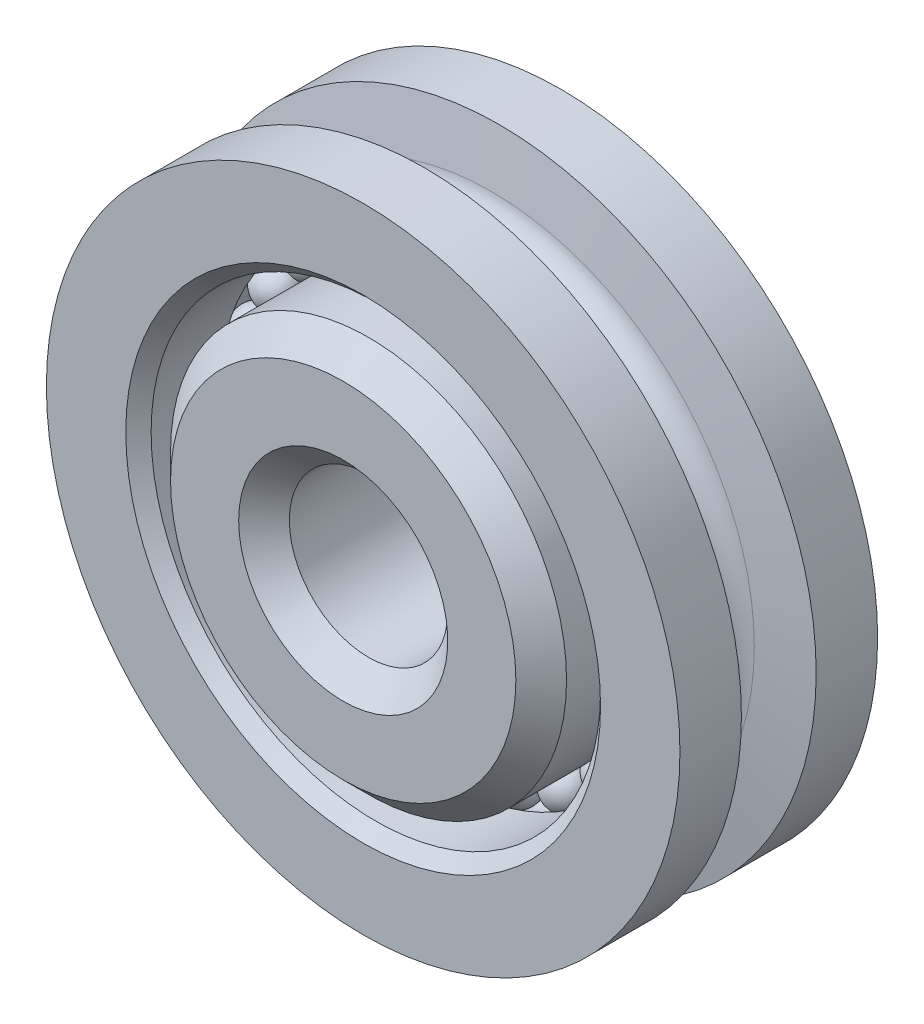
ISO-10303-21;
HEADER;
FILE_DESCRIPTION(('STEP AP214'),'2;1');
FILE_NAME('part.step','',(''),(''),'','','');
FILE_SCHEMA(('AUTOMOTIVE_DESIGN { 1 0 10303 214 1 1 1 1 }'));
ENDSEC;
DATA;
#1=APPLICATION_CONTEXT('core data for automotive mechanical design processes');
#2=APPLICATION_PROTOCOL_DEFINITION('international standard','automotive_design',2000,#1);
#3=PRODUCT_CONTEXT('',#1,'mechanical');
#4=PRODUCT('Part','Part','',(#3));
#5=PRODUCT_RELATED_PRODUCT_CATEGORY('part','',(#4));
#6=PRODUCT_DEFINITION_FORMATION('','',#4);
#7=PRODUCT_DEFINITION_CONTEXT('part definition',#1,'design');
#8=PRODUCT_DEFINITION('design','',#6,#7);
#9=PRODUCT_DEFINITION_SHAPE('','',#8);
#10=(LENGTH_UNIT() NAMED_UNIT(*) SI_UNIT(.MILLI.,.METRE.));
#11=(NAMED_UNIT(*) PLANE_ANGLE_UNIT() SI_UNIT($,.RADIAN.));
#12=(NAMED_UNIT(*) SI_UNIT($,.STERADIAN.) SOLID_ANGLE_UNIT());
#13=UNCERTAINTY_MEASURE_WITH_UNIT(LENGTH_MEASURE(1.E-05),#10,'distance_accuracy_value','');
#14=(GEOMETRIC_REPRESENTATION_CONTEXT(3) GLOBAL_UNCERTAINTY_ASSIGNED_CONTEXT((#13)) GLOBAL_UNIT_ASSIGNED_CONTEXT((#10,
#11,#12)) REPRESENTATION_CONTEXT('',''));
#15=CARTESIAN_POINT('',(0.,0.,0.));
#16=DIRECTION('',(0.,0.,1.));
#17=DIRECTION('',(1.,0.,0.));
#18=AXIS2_PLACEMENT_3D('',#15,#16,#17);
#19=CARTESIAN_POINT('',(1.09652328100494,4.09228059639296,0.));
#20=DIRECTION('',(0.258819045102507,0.965925826289075,0.));
#21=DIRECTION('',(0.,0.,-1.));
#22=AXIS2_PLACEMENT_3D('',#19,#20,#21);
#23=SPHERICAL_SURFACE('',#22,0.446484375);
#24=CARTESIAN_POINT('',(1.21208194059563,4.52355138524,0.));
#25=VERTEX_POINT('',#24);
#26=VERTEX_LOOP('',#25);
#27=FACE_BOUND('',#26,.T.);
#28=ADVANCED_FACE('F37',(#27),#23,.T.);
#29=CLOSED_SHELL('',(#28));
#30=MANIFOLD_SOLID_BREP('B2',#29);
#31=CARTESIAN_POINT('',(2.11832031249993,3.66903840795517,0.));
#32=DIRECTION('',(0.499999999999988,0.866025403784448,0.));
#33=DIRECTION('',(0.,0.,-1.));
#34=AXIS2_PLACEMENT_3D('',#31,#32,#33);
#35=SPHERICAL_SURFACE('',#34,0.446484375);
#36=CARTESIAN_POINT('',(2.34156249999992,4.05570521909799,0.));
#37=VERTEX_POINT('',#36);
#38=VERTEX_LOOP('',#37);
#39=FACE_BOUND('',#38,.T.);
#40=ADVANCED_FACE('F55',(#39),#35,.T.);
#41=CLOSED_SHELL('',(#40));
#42=MANIFOLD_SOLID_BREP('B6',#41);
#43=CARTESIAN_POINT('',(2.99575731538787,2.99575731538791,0.));
#44=DIRECTION('',(0.707106781186538,0.707106781186558,0.));
#45=DIRECTION('',(0.,0.,-1.));
#46=AXIS2_PLACEMENT_3D('',#43,#44,#45);
#47=SPHERICAL_SURFACE('',#46,0.446484375);
#48=CARTESIAN_POINT('',(3.3114694446442,3.31146944464425,0.));
#49=VERTEX_POINT('',#48);
#50=VERTEX_LOOP('',#49);
#51=FACE_BOUND('',#50,.T.);
#52=ADVANCED_FACE('F73',(#51),#47,.T.);
#53=CLOSED_SHELL('',(#52));
#54=MANIFOLD_SOLID_BREP('B33',#53);
#55=CARTESIAN_POINT('',(3.66903840795513,2.11832031249999,0.));
#56=DIRECTION('',(0.866025403784432,0.500000000000011,0.));
#57=DIRECTION('',(0.,0.,-1.));
#58=AXIS2_PLACEMENT_3D('',#55,#56,#57);
#59=SPHERICAL_SURFACE('',#58,0.446484375);
#60=CARTESIAN_POINT('',(4.05570521909794,2.34156249999999,0.));
#61=VERTEX_POINT('',#60);
#62=VERTEX_LOOP('',#61);
#63=FACE_BOUND('',#62,.T.);
#64=ADVANCED_FACE('F91',(#63),#59,.T.);
#65=CLOSED_SHELL('',(#64));
#66=MANIFOLD_SOLID_BREP('B51',#65);
#67=CARTESIAN_POINT('',(4.09228059639297,1.09652328100507,0.));
#68=DIRECTION('',(0.965925826289065,0.258819045102532,0.));
#69=DIRECTION('',(0.,0.,-1.));
#70=AXIS2_PLACEMENT_3D('',#67,#68,#69);
#71=SPHERICAL_SURFACE('',#70,0.446484375);
#72=CARTESIAN_POINT('',(4.52355138524,1.21208194059577,0.));
#73=VERTEX_POINT('',#72);
#74=VERTEX_LOOP('',#73);
#75=FACE_BOUND('',#74,.T.);
#76=ADVANCED_FACE('F109',(#75),#71,.T.);
#77=CLOSED_SHELL('',(#76));
#78=MANIFOLD_SOLID_BREP('B69',#77);
#79=CARTESIAN_POINT('',(4.23664062499996,0.,0.));
#80=DIRECTION('',(1.,0.,0.));
#81=DIRECTION('',(0.,0.,-1.));
#82=AXIS2_PLACEMENT_3D('',#79,#80,#81);
#83=SPHERICAL_SURFACE('',#82,0.446484375);
#84=CARTESIAN_POINT('',(4.68312499999996,0.,0.));
#85=VERTEX_POINT('',#84);
#86=VERTEX_LOOP('',#85);
#87=FACE_BOUND('',#86,.T.);
#88=ADVANCED_FACE('F127',(#87),#83,.T.);
#89=CLOSED_SHELL('',(#88));
#90=MANIFOLD_SOLID_BREP('B87',#89);
#91=CARTESIAN_POINT('',(4.09228059639292,-1.09652328100507,0.));
#92=DIRECTION('',(0.96592582628907,-0.258819045102512,0.));
#93=DIRECTION('',(0.,0.,-1.));
#94=AXIS2_PLACEMENT_3D('',#91,#92,#93);
#95=SPHERICAL_SURFACE('',#94,0.446484375);
#96=CARTESIAN_POINT('',(4.52355138523995,-1.21208194059576,0.));
#97=VERTEX_POINT('',#96);
#98=VERTEX_LOOP('',#97);
#99=FACE_BOUND('',#98,.T.);
#100=ADVANCED_FACE('F145',(#99),#95,.T.);
#101=CLOSED_SHELL('',(#100));
#102=MANIFOLD_SOLID_BREP('B105',#101);
#103=CARTESIAN_POINT('',(3.66903840795521,-2.11832031249998,0.));
#104=DIRECTION('',(0.866025403784443,-0.499999999999993,0.));
#105=DIRECTION('',(0.,0.,-1.));
#106=AXIS2_PLACEMENT_3D('',#103,#104,#105);
#107=SPHERICAL_SURFACE('',#106,0.446484375);
#108=CARTESIAN_POINT('',(4.05570521909803,-2.34156249999998,0.));
#109=VERTEX_POINT('',#108);
#110=VERTEX_LOOP('',#109);
#111=FACE_BOUND('',#110,.T.);
#112=ADVANCED_FACE('F163',(#111),#107,.T.);
#113=CLOSED_SHELL('',(#112));
#114=MANIFOLD_SOLID_BREP('B123',#113);
#115=CARTESIAN_POINT('',(2.99575731538792,-2.99575731538795,0.));
#116=DIRECTION('',(0.707106781186553,-0.707106781186543,0.));
#117=DIRECTION('',(0.,0.,-1.));
#118=AXIS2_PLACEMENT_3D('',#115,#116,#117);
#119=SPHERICAL_SURFACE('',#118,0.446484375);
#120=CARTESIAN_POINT('',(3.31146944464426,-3.31146944464428,0.));
#121=VERTEX_POINT('',#120);
#122=VERTEX_LOOP('',#121);
#123=FACE_BOUND('',#122,.T.);
#124=ADVANCED_FACE('F181',(#123),#119,.T.);
#125=CLOSED_SHELL('',(#124));
#126=MANIFOLD_SOLID_BREP('B141',#125);
#127=CARTESIAN_POINT('',(2.11832031250006,-3.66903840795521,0.));
#128=DIRECTION('',(0.500000000000007,-0.866025403784437,0.));
#129=DIRECTION('',(0.,0.,-1.));
#130=AXIS2_PLACEMENT_3D('',#127,#128,#129);
#131=SPHERICAL_SURFACE('',#130,0.446484375);
#132=CARTESIAN_POINT('',(2.34156250000006,-4.05570521909803,0.));
#133=VERTEX_POINT('',#132);
#134=VERTEX_LOOP('',#133);
#135=FACE_BOUND('',#134,.T.);
#136=ADVANCED_FACE('F199',(#135),#131,.T.);
#137=CLOSED_SHELL('',(#136));
#138=MANIFOLD_SOLID_BREP('B159',#137);
#139=CARTESIAN_POINT('',(1.09652328100505,-4.09228059639302,0.));
#140=DIRECTION('',(0.258819045102528,-0.965925826289069,0.));
#141=DIRECTION('',(0.,0.,-1.));
#142=AXIS2_PLACEMENT_3D('',#139,#140,#141);
#143=SPHERICAL_SURFACE('',#142,0.446484375);
#144=CARTESIAN_POINT('',(1.21208194059575,-4.52355138524006,0.));
#145=VERTEX_POINT('',#144);
#146=VERTEX_LOOP('',#145);
#147=FACE_BOUND('',#146,.T.);
#148=ADVANCED_FACE('F217',(#147),#143,.T.);
#149=CLOSED_SHELL('',(#148));
#150=MANIFOLD_SOLID_BREP('B177',#149);
#151=CARTESIAN_POINT('',(0.,-4.23664062500007,0.));
#152=DIRECTION('',(0.,-1.,0.));
#153=DIRECTION('',(0.,0.,-1.));
#154=AXIS2_PLACEMENT_3D('',#151,#152,#153);
#155=SPHERICAL_SURFACE('',#154,0.446484375);
#156=CARTESIAN_POINT('',(0.,-4.68312500000007,0.));
#157=VERTEX_POINT('',#156);
#158=VERTEX_LOOP('',#157);
#159=FACE_BOUND('',#158,.T.);
#160=ADVANCED_FACE('F235',(#159),#155,.T.);
#161=CLOSED_SHELL('',(#160));
#162=MANIFOLD_SOLID_BREP('B195',#161);
#163=CARTESIAN_POINT('',(-1.09652328100505,-4.09228059639299,0.));
#164=DIRECTION('',(-0.258819045102514,-0.965925826289073,0.));
#165=DIRECTION('',(0.,0.,-1.));
#166=AXIS2_PLACEMENT_3D('',#163,#164,#165);
#167=SPHERICAL_SURFACE('',#166,0.446484375);
#168=CARTESIAN_POINT('',(-1.21208194059575,-4.52355138524003,0.));
#169=VERTEX_POINT('',#168);
#170=VERTEX_LOOP('',#169);
#171=FACE_BOUND('',#170,.T.);
#172=ADVANCED_FACE('F253',(#171),#167,.T.);
#173=CLOSED_SHELL('',(#172));
#174=MANIFOLD_SOLID_BREP('B213',#173);
#175=CARTESIAN_POINT('',(-2.11832031250002,-3.66903840795525,0.));
#176=DIRECTION('',(-0.499999999999995,-0.866025403784444,0.));
#177=DIRECTION('',(0.,0.,-1.));
#178=AXIS2_PLACEMENT_3D('',#175,#176,#177);
#179=SPHERICAL_SURFACE('',#178,0.446484375);
#180=CARTESIAN_POINT('',(-2.34156250000002,-4.05570521909807,0.));
#181=VERTEX_POINT('',#180);
#182=VERTEX_LOOP('',#181);
#183=FACE_BOUND('',#182,.T.);
#184=ADVANCED_FACE('F271',(#183),#179,.T.);
#185=CLOSED_SHELL('',(#184));
#186=MANIFOLD_SOLID_BREP('B231',#185);
#187=CARTESIAN_POINT('',(-2.99575731538794,-2.99575731538796,0.));
#188=DIRECTION('',(-0.707106781186543,-0.707106781186553,0.));
#189=DIRECTION('',(0.,0.,-1.));
#190=AXIS2_PLACEMENT_3D('',#187,#188,#189);
#191=SPHERICAL_SURFACE('',#190,0.446484375);
#192=CARTESIAN_POINT('',(-3.31146944464428,-3.3114694446443,0.));
#193=VERTEX_POINT('',#192);
#194=VERTEX_LOOP('',#193);
#195=FACE_BOUND('',#194,.T.);
#196=ADVANCED_FACE('F289',(#195),#191,.T.);
#197=CLOSED_SHELL('',(#196));
#198=MANIFOLD_SOLID_BREP('B249',#197);
#199=CARTESIAN_POINT('',(-3.66903840795519,-2.11832031250008,0.));
#200=DIRECTION('',(-0.866025403784436,-0.500000000000005,0.));
#201=DIRECTION('',(0.,0.,-1.));
#202=AXIS2_PLACEMENT_3D('',#199,#200,#201);
#203=SPHERICAL_SURFACE('',#202,0.446484375);
#204=CARTESIAN_POINT('',(-4.05570521909801,-2.34156250000009,0.));
#205=VERTEX_POINT('',#204);
#206=VERTEX_LOOP('',#205);
#207=FACE_BOUND('',#206,.T.);
#208=ADVANCED_FACE('F307',(#207),#203,.T.);
#209=CLOSED_SHELL('',(#208));
#210=MANIFOLD_SOLID_BREP('B267',#209);
#211=CARTESIAN_POINT('',(-4.09228059639301,-1.0965232810051,0.));
#212=DIRECTION('',(-0.965925826289067,-0.258819045102525,0.));
#213=DIRECTION('',(0.,0.,-1.));
#214=AXIS2_PLACEMENT_3D('',#211,#212,#213);
#215=SPHERICAL_SURFACE('',#214,0.446484375);
#216=CARTESIAN_POINT('',(-4.52355138524004,-1.21208194059579,0.));
#217=VERTEX_POINT('',#216);
#218=VERTEX_LOOP('',#217);
#219=FACE_BOUND('',#218,.T.);
#220=ADVANCED_FACE('F325',(#219),#215,.T.);
#221=CLOSED_SHELL('',(#220));
#222=MANIFOLD_SOLID_BREP('B285',#221);
#223=CARTESIAN_POINT('',(-4.23664062500002,-1.11022302462516E-13,0.));
#224=DIRECTION('',(-0.999999999999999,0.,0.));
#225=DIRECTION('',(0.,0.,-1.));
#226=AXIS2_PLACEMENT_3D('',#223,#224,#225);
#227=SPHERICAL_SURFACE('',#226,0.446484375);
#228=CARTESIAN_POINT('',(-4.68312500000002,-1.12633318470612E-13,0.));
#229=VERTEX_POINT('',#228);
#230=VERTEX_LOOP('',#229);
#231=FACE_BOUND('',#230,.T.);
#232=ADVANCED_FACE('F343',(#231),#227,.T.);
#233=CLOSED_SHELL('',(#232));
#234=MANIFOLD_SOLID_BREP('B303',#233);
#235=CARTESIAN_POINT('',(-4.09228059639304,1.09652328100495,0.));
#236=DIRECTION('',(-0.965925826289069,0.258819045102519,0.));
#237=DIRECTION('',(0.,0.,-1.));
#238=AXIS2_PLACEMENT_3D('',#235,#236,#237);
#239=SPHERICAL_SURFACE('',#238,0.446484375);
#240=CARTESIAN_POINT('',(-4.52355138524008,1.21208194059564,0.));
#241=VERTEX_POINT('',#240);
#242=VERTEX_LOOP('',#241);
#243=FACE_BOUND('',#242,.T.);
#244=ADVANCED_FACE('F361',(#243),#239,.T.);
#245=CLOSED_SHELL('',(#244));
#246=MANIFOLD_SOLID_BREP('B321',#245);
#247=CARTESIAN_POINT('',(-3.66903840795522,2.11832031249995,0.));
#248=DIRECTION('',(-0.866025403784439,0.499999999999999,0.));
#249=DIRECTION('',(0.,0.,-1.));
#250=AXIS2_PLACEMENT_3D('',#247,#248,#249);
#251=SPHERICAL_SURFACE('',#250,0.446484375);
#252=CARTESIAN_POINT('',(-4.05570521909804,2.34156249999995,0.));
#253=VERTEX_POINT('',#252);
#254=VERTEX_LOOP('',#253);
#255=FACE_BOUND('',#254,.T.);
#256=ADVANCED_FACE('F379',(#255),#251,.T.);
#257=CLOSED_SHELL('',(#256));
#258=MANIFOLD_SOLID_BREP('B339',#257);
#259=CARTESIAN_POINT('',(-2.99575731538797,2.99575731538784,0.));
#260=DIRECTION('',(-0.707106781186549,0.707106781186548,0.));
#261=DIRECTION('',(0.,0.,-1.));
#262=AXIS2_PLACEMENT_3D('',#259,#260,#261);
#263=SPHERICAL_SURFACE('',#262,0.446484375);
#264=CARTESIAN_POINT('',(-3.31146944464431,3.31146944464418,0.));
#265=VERTEX_POINT('',#264);
#266=VERTEX_LOOP('',#265);
#267=FACE_BOUND('',#266,.T.);
#268=ADVANCED_FACE('F397',(#267),#263,.T.);
#269=CLOSED_SHELL('',(#268));
#270=MANIFOLD_SOLID_BREP('B357',#269);
#271=CARTESIAN_POINT('',(-2.11832031250005,3.66903840795516,0.));
#272=DIRECTION('',(-0.500000000000001,0.866025403784441,0.));
#273=DIRECTION('',(0.,0.,-1.));
#274=AXIS2_PLACEMENT_3D('',#271,#272,#273);
#275=SPHERICAL_SURFACE('',#274,0.446484375);
#276=CARTESIAN_POINT('',(-2.34156250000005,4.05570521909797,0.));
#277=VERTEX_POINT('',#276);
#278=VERTEX_LOOP('',#277);
#279=FACE_BOUND('',#278,.T.);
#280=ADVANCED_FACE('F415',(#279),#275,.T.);
#281=CLOSED_SHELL('',(#280));
#282=MANIFOLD_SOLID_BREP('B375',#281);
#283=CARTESIAN_POINT('',(-1.0965232810051,4.09228059639292,0.));
#284=DIRECTION('',(-0.258819045102522,0.965925826289071,0.));
#285=DIRECTION('',(0.,0.,-1.));
#286=AXIS2_PLACEMENT_3D('',#283,#284,#285);
#287=SPHERICAL_SURFACE('',#286,0.446484375);
#288=CARTESIAN_POINT('',(-1.21208194059579,4.52355138523995,0.));
#289=VERTEX_POINT('',#288);
#290=VERTEX_LOOP('',#289);
#291=FACE_BOUND('',#290,.T.);
#292=ADVANCED_FACE('F433',(#291),#287,.T.);
#293=CLOSED_SHELL('',(#292));
#294=MANIFOLD_SOLID_BREP('B393',#293);
#295=CARTESIAN_POINT('',(0.,4.23664062499995,0.));
#296=DIRECTION('',(0.,1.,0.));
#297=DIRECTION('',(0.,0.,-1.));
#298=AXIS2_PLACEMENT_3D('',#295,#296,#297);
#299=SPHERICAL_SURFACE('',#298,0.446484375);
#300=CARTESIAN_POINT('',(0.,4.68312499999996,0.));
#301=VERTEX_POINT('',#300);
#302=VERTEX_LOOP('',#301);
#303=FACE_BOUND('',#302,.T.);
#304=ADVANCED_FACE('F453',(#303),#299,.T.);
#305=CLOSED_SHELL('',(#304));
#306=MANIFOLD_SOLID_BREP('B411',#305);
#307=CARTESIAN_POINT('',(0.,3.96875,2.38124999999997));
#308=DIRECTION('',(0.,0.,-1.));
#309=DIRECTION('',(-0.999999999999999,0.,0.));
#310=AXIS2_PLACEMENT_3D('',#307,#308,#309);
#311=PLANE('',#310);
#312=CARTESIAN_POINT('',(0.,0.,2.38124999999989));
#313=DIRECTION('',(0.,0.,-1.));
#314=DIRECTION('',(-0.999999999999999,0.,0.));
#315=AXIS2_PLACEMENT_3D('',#312,#313,#314);
#316=CIRCLE('',#315,3.46075);
#317=CARTESIAN_POINT('',(-3.46075000000004,0.,2.38124999999989));
#318=VERTEX_POINT('',#317);
#319=EDGE_CURVE('E479',#318,#318,#316,.F.);
#320=ORIENTED_EDGE('',*,*,#319,.T.);
#321=EDGE_LOOP('',(#320));
#322=FACE_BOUND('',#321,.T.);
#323=CARTESIAN_POINT('',(0.,0.,2.38124999999989));
#324=DIRECTION('',(0.,0.,-1.));
#325=DIRECTION('',(-0.999999999999999,0.,0.));
#326=AXIS2_PLACEMENT_3D('',#323,#324,#325);
#327=CIRCLE('',#326,2.09550000000001);
#328=CARTESIAN_POINT('',(-2.09550000000005,0.,2.38124999999989));
#329=VERTEX_POINT('',#328);
#330=EDGE_CURVE('E483',#329,#329,#327,.T.);
#331=ORIENTED_EDGE('',*,*,#330,.T.);
#332=EDGE_LOOP('',(#331));
#333=FACE_BOUND('',#332,.T.);
#334=ADVANCED_FACE('F472',(#322,#333),#311,.F.);
#335=CARTESIAN_POINT('',(0.,0.,2.38124999999989));
#336=DIRECTION('',(0.,0.,1.));
#337=DIRECTION('',(0.999999999999999,0.,0.));
#338=AXIS2_PLACEMENT_3D('',#335,#336,#337);
#339=CYLINDRICAL_SURFACE('',#338,1.5875);
#340=CARTESIAN_POINT('',(0.,0.,-1.87325000000001));
#341=DIRECTION('',(0.,0.,1.));
#342=DIRECTION('',(0.999999999999999,0.,0.));
#343=AXIS2_PLACEMENT_3D('',#340,#341,#342);
#344=CIRCLE('',#343,1.5875);
#345=CARTESIAN_POINT('',(1.58749999999993,0.,-1.87325000000001));
#346=VERTEX_POINT('',#345);
#347=EDGE_CURVE('E492',#346,#346,#344,.F.);
#348=ORIENTED_EDGE('',*,*,#347,.T.);
#349=EDGE_LOOP('',(#348));
#350=FACE_BOUND('',#349,.T.);
#351=CARTESIAN_POINT('',(0.,0.,1.87324999999992));
#352=DIRECTION('',(0.,0.,-1.));
#353=DIRECTION('',(-0.999999999999999,0.,0.));
#354=AXIS2_PLACEMENT_3D('',#351,#352,#353);
#355=CIRCLE('',#354,1.5875);
#356=CARTESIAN_POINT('',(-1.58750000000004,0.,1.87324999999992));
#357=VERTEX_POINT('',#356);
#358=EDGE_CURVE('E495',#357,#357,#355,.F.);
#359=ORIENTED_EDGE('',*,*,#358,.T.);
#360=EDGE_LOOP('',(#359));
#361=FACE_BOUND('',#360,.T.);
#362=ADVANCED_FACE('F527',(#350,#361),#339,.F.);
#363=CARTESIAN_POINT('',(0.,3.96874999999996,-2.38125000000003));
#364=DIRECTION('',(0.,0.,1.));
#365=DIRECTION('',(0.999999999999999,0.,0.));
#366=AXIS2_PLACEMENT_3D('',#363,#364,#365);
#367=PLANE('',#366);
#368=CARTESIAN_POINT('',(0.,0.,-2.38125000000004));
#369=DIRECTION('',(0.,0.,1.));
#370=DIRECTION('',(0.999999999999999,0.,0.));
#371=AXIS2_PLACEMENT_3D('',#368,#369,#370);
#372=CIRCLE('',#371,2.0955);
#373=CARTESIAN_POINT('',(2.09549999999996,0.,-2.38125000000004));
#374=VERTEX_POINT('',#373);
#375=EDGE_CURVE('E498',#374,#374,#372,.T.);
#376=ORIENTED_EDGE('',*,*,#375,.T.);
#377=EDGE_LOOP('',(#376));
#378=FACE_BOUND('',#377,.T.);
#379=CARTESIAN_POINT('',(0.,0.,-2.38125000000004));
#380=DIRECTION('',(0.,0.,1.));
#381=DIRECTION('',(0.999999999999999,0.,0.));
#382=AXIS2_PLACEMENT_3D('',#379,#380,#381);
#383=CIRCLE('',#382,3.46075);
#384=CARTESIAN_POINT('',(3.46074999999996,0.,-2.38125000000004));
#385=VERTEX_POINT('',#384);
#386=EDGE_CURVE('E501',#385,#385,#383,.F.);
#387=ORIENTED_EDGE('',*,*,#386,.T.);
#388=EDGE_LOOP('',(#387));
#389=FACE_BOUND('',#388,.T.);
#390=ADVANCED_FACE('F521',(#378,#389),#367,.F.);
#391=CARTESIAN_POINT('',(0.,0.,2.38124999999989));
#392=DIRECTION('',(0.,0.,1.));
#393=DIRECTION('',(0.999999999999999,0.,0.));
#394=AXIS2_PLACEMENT_3D('',#391,#392,#393);
#395=CYLINDRICAL_SURFACE('',#394,3.96875);
#396=CARTESIAN_POINT('',(0.,0.,-1.87325000000008));
#397=DIRECTION('',(0.,0.,1.));
#398=DIRECTION('',(0.999999999999999,0.,0.));
#399=AXIS2_PLACEMENT_3D('',#396,#397,#398);
#400=CIRCLE('',#399,3.96875);
#401=CARTESIAN_POINT('',(3.96874999999996,0.,-1.87325000000008));
#402=VERTEX_POINT('',#401);
#403=EDGE_CURVE('E487',#402,#402,#400,.T.);
#404=ORIENTED_EDGE('',*,*,#403,.T.);
#405=EDGE_LOOP('',(#404));
#406=FACE_BOUND('',#405,.T.);
#407=CARTESIAN_POINT('',(0.,0.,-0.357187500000106));
#408=DIRECTION('',(0.,0.,1.));
#409=DIRECTION('',(0.999999999999999,0.,0.));
#410=AXIS2_PLACEMENT_3D('',#407,#408,#409);
#411=CIRCLE('',#410,3.96875);
#412=CARTESIAN_POINT('',(3.96874999999994,0.,-0.357187500000107));
#413=VERTEX_POINT('',#412);
#414=EDGE_CURVE('E504',#413,#413,#411,.T.);
#415=ORIENTED_EDGE('',*,*,#414,.F.);
#416=EDGE_LOOP('',(#415));
#417=FACE_BOUND('',#416,.T.);
#418=ADVANCED_FACE('F516',(#406,#417),#395,.T.);
#419=CARTESIAN_POINT('',(0.,0.,0.));
#420=DIRECTION('',(0.,0.,1.));
#421=DIRECTION('',(0.999999999999999,0.,0.));
#422=AXIS2_PLACEMENT_3D('',#419,#420,#421);
#423=TOROIDAL_SURFACE('',#422,4.236640625,0.446484375);
#424=CARTESIAN_POINT('',(0.,0.,0.357187499999925));
#425=DIRECTION('',(0.,0.,1.));
#426=DIRECTION('',(0.999999999999999,0.,0.));
#427=AXIS2_PLACEMENT_3D('',#424,#425,#426);
#428=CIRCLE('',#427,3.96875);
#429=CARTESIAN_POINT('',(3.96874999999997,0.,0.357187499999924));
#430=VERTEX_POINT('',#429);
#431=EDGE_CURVE('E507',#430,#430,#428,.T.);
#432=ORIENTED_EDGE('',*,*,#431,.F.);
#433=EDGE_LOOP('',(#432));
#434=FACE_BOUND('',#433,.T.);
#435=ORIENTED_EDGE('',*,*,#414,.T.);
#436=EDGE_LOOP('',(#435));
#437=FACE_BOUND('',#436,.T.);
#438=ADVANCED_FACE('F513',(#434,#437),#423,.F.);
#439=CARTESIAN_POINT('',(0.,0.,2.38124999999989));
#440=DIRECTION('',(0.,0.,1.));
#441=DIRECTION('',(0.999999999999999,0.,0.));
#442=AXIS2_PLACEMENT_3D('',#439,#440,#441);
#443=CYLINDRICAL_SURFACE('',#442,3.96875);
#444=CARTESIAN_POINT('',(0.,0.,1.87324999999992));
#445=DIRECTION('',(0.,0.,-1.));
#446=DIRECTION('',(-0.999999999999999,0.,0.));
#447=AXIS2_PLACEMENT_3D('',#444,#445,#446);
#448=CIRCLE('',#447,3.96875);
#449=CARTESIAN_POINT('',(-3.96875000000004,0.,1.87324999999993));
#450=VERTEX_POINT('',#449);
#451=EDGE_CURVE('E452',#450,#450,#448,.T.);
#452=ORIENTED_EDGE('',*,*,#451,.T.);
#453=EDGE_LOOP('',(#452));
#454=FACE_BOUND('',#453,.T.);
#455=ORIENTED_EDGE('',*,*,#431,.T.);
#456=EDGE_LOOP('',(#455));
#457=FACE_BOUND('',#456,.T.);
#458=ADVANCED_FACE('F511',(#454,#457),#443,.T.);
#459=CARTESIAN_POINT('',(0.,0.,-2.38125000000004));
#460=DIRECTION('',(0.,0.,-1.));
#461=DIRECTION('',(-0.999999999999999,0.,0.));
#462=AXIS2_PLACEMENT_3D('',#459,#460,#461);
#463=CONICAL_SURFACE('',#462,2.0955,0.785398163397447);
#464=ORIENTED_EDGE('',*,*,#347,.F.);
#465=EDGE_LOOP('',(#464));
#466=FACE_BOUND('',#465,.T.);
#467=ORIENTED_EDGE('',*,*,#375,.F.);
#468=EDGE_LOOP('',(#467));
#469=FACE_BOUND('',#468,.T.);
#470=ADVANCED_FACE('F539',(#466,#469),#463,.F.);
#471=CARTESIAN_POINT('',(0.,0.,-1.87325000000008));
#472=DIRECTION('',(0.,0.,1.));
#473=DIRECTION('',(0.999999999999999,0.,0.));
#474=AXIS2_PLACEMENT_3D('',#471,#472,#473);
#475=CONICAL_SURFACE('',#474,3.96875,0.785398163397451);
#476=ORIENTED_EDGE('',*,*,#386,.F.);
#477=EDGE_LOOP('',(#476));
#478=FACE_BOUND('',#477,.T.);
#479=ORIENTED_EDGE('',*,*,#403,.F.);
#480=EDGE_LOOP('',(#479));
#481=FACE_BOUND('',#480,.T.);
#482=ADVANCED_FACE('F542',(#478,#481),#475,.T.);
#483=CARTESIAN_POINT('',(0.,0.,2.38124999999989));
#484=DIRECTION('',(0.,0.,-1.));
#485=DIRECTION('',(-0.999999999999999,0.,0.));
#486=AXIS2_PLACEMENT_3D('',#483,#484,#485);
#487=CONICAL_SURFACE('',#486,3.46075,0.785398163397447);
#488=ORIENTED_EDGE('',*,*,#451,.F.);
#489=EDGE_LOOP('',(#488));
#490=FACE_BOUND('',#489,.T.);
#491=ORIENTED_EDGE('',*,*,#319,.F.);
#492=EDGE_LOOP('',(#491));
#493=FACE_BOUND('',#492,.T.);
#494=ADVANCED_FACE('F545',(#490,#493),#487,.T.);
#495=CARTESIAN_POINT('',(0.,0.,1.87324999999992));
#496=DIRECTION('',(0.,0.,1.));
#497=DIRECTION('',(0.999999999999999,0.,0.));
#498=AXIS2_PLACEMENT_3D('',#495,#496,#497);
#499=CONICAL_SURFACE('',#498,1.5875,0.78539816339745);
#500=ORIENTED_EDGE('',*,*,#330,.F.);
#501=EDGE_LOOP('',(#500));
#502=FACE_BOUND('',#501,.T.);
#503=ORIENTED_EDGE('',*,*,#358,.F.);
#504=EDGE_LOOP('',(#503));
#505=FACE_BOUND('',#504,.T.);
#506=ADVANCED_FACE('F474',(#502,#505),#499,.F.);
#507=CLOSED_SHELL('',(#334,#362,#390,#418,#438,#458,#470,#482,#494,#506));
#508=MANIFOLD_SOLID_BREP('B429',#507);
#509=CARTESIAN_POINT('',(0.,0.,0.));
#510=DIRECTION('',(0.,0.,1.));
#511=DIRECTION('',(0.999999999999999,0.,0.));
#512=AXIS2_PLACEMENT_3D('',#509,#510,#511);
#513=TOROIDAL_SURFACE('',#512,5.3578125,0.5953125);
#514=CARTESIAN_POINT('',(0.,0.,0.588845645764391));
#515=DIRECTION('',(0.,0.,1.));
#516=DIRECTION('',(0.999999999999999,0.,0.));
#517=AXIS2_PLACEMENT_3D('',#514,#515,#516);
#518=CIRCLE('',#517,5.27030376831867);
#519=CARTESIAN_POINT('',(5.27030376831863,0.,0.58884564576439));
#520=VERTEX_POINT('',#519);
#521=EDGE_CURVE('E643',#520,#520,#518,.T.);
#522=ORIENTED_EDGE('',*,*,#521,.F.);
#523=EDGE_LOOP('',(#522));
#524=FACE_BOUND('',#523,.T.);
#525=CARTESIAN_POINT('',(0.,0.,-0.588845645764537));
#526=DIRECTION('',(0.,0.,1.));
#527=DIRECTION('',(0.999999999999999,0.,0.));
#528=AXIS2_PLACEMENT_3D('',#525,#526,#527);
#529=CIRCLE('',#528,5.27030376831867);
#530=CARTESIAN_POINT('',(5.27030376831866,0.,-0.588845645764538));
#531=VERTEX_POINT('',#530);
#532=EDGE_CURVE('E664',#531,#531,#529,.T.);
#533=ORIENTED_EDGE('',*,*,#532,.T.);
#534=EDGE_LOOP('',(#533));
#535=FACE_BOUND('',#534,.T.);
#536=ADVANCED_FACE('F623',(#524,#535),#513,.F.);
#537=CARTESIAN_POINT('',(0.,0.,0.588845645764391));
#538=DIRECTION('',(0.,0.,1.));
#539=DIRECTION('',(0.999999999999999,0.,0.));
#540=AXIS2_PLACEMENT_3D('',#537,#538,#539);
#541=CONICAL_SURFACE('',#540,5.27030376831867,1.42326543698228);
#542=CARTESIAN_POINT('',(0.,0.,0.749299999999953));
#543=DIRECTION('',(0.,0.,1.));
#544=DIRECTION('',(0.999999999999999,0.,0.));
#545=AXIS2_PLACEMENT_3D('',#542,#543,#544);
#546=CIRCLE('',#545,6.35);
#547=CARTESIAN_POINT('',(6.34999999999998,0.,0.749299999999951));
#548=VERTEX_POINT('',#547);
#549=EDGE_CURVE('E646',#548,#548,#546,.T.);
#550=ORIENTED_EDGE('',*,*,#549,.F.);
#551=EDGE_LOOP('',(#550));
#552=FACE_BOUND('',#551,.T.);
#553=ORIENTED_EDGE('',*,*,#521,.T.);
#554=EDGE_LOOP('',(#553));
#555=FACE_BOUND('',#554,.T.);
#556=ADVANCED_FACE('F694',(#552,#555),#541,.T.);
#557=CARTESIAN_POINT('',(0.,0.,2.38124999999997));
#558=DIRECTION('',(0.,0.,1.));
#559=DIRECTION('',(0.999999999999999,0.,0.));
#560=AXIS2_PLACEMENT_3D('',#557,#558,#559);
#561=CYLINDRICAL_SURFACE('',#560,6.35);
#562=CARTESIAN_POINT('',(0.,0.,1.98119999999994));
#563=DIRECTION('',(0.,0.,1.));
#564=DIRECTION('',(0.999999999999999,0.,0.));
#565=AXIS2_PLACEMENT_3D('',#562,#563,#564);
#566=CIRCLE('',#565,6.35);
#567=CARTESIAN_POINT('',(6.34999999999995,0.,1.98119999999994));
#568=VERTEX_POINT('',#567);
#569=EDGE_CURVE('E649',#568,#568,#566,.T.);
#570=ORIENTED_EDGE('',*,*,#569,.F.);
#571=EDGE_LOOP('',(#570));
#572=FACE_BOUND('',#571,.T.);
#573=ORIENTED_EDGE('',*,*,#549,.T.);
#574=EDGE_LOOP('',(#573));
#575=FACE_BOUND('',#574,.T.);
#576=ADVANCED_FACE('F700',(#572,#575),#561,.T.);
#577=CARTESIAN_POINT('',(0.,4.50453125,1.98119999999994));
#578=DIRECTION('',(0.,0.,-1.));
#579=DIRECTION('',(-0.999999999999999,0.,0.));
#580=AXIS2_PLACEMENT_3D('',#577,#578,#579);
#581=PLANE('',#580);
#582=CARTESIAN_POINT('',(0.,0.,1.98119999999994));
#583=DIRECTION('',(0.,0.,-1.));
#584=DIRECTION('',(-0.999999999999999,0.,0.));
#585=AXIS2_PLACEMENT_3D('',#582,#583,#584);
#586=CIRCLE('',#585,4.75853125);
#587=CARTESIAN_POINT('',(-4.75853125000004,0.,1.98119999999994));
#588=VERTEX_POINT('',#587);
#589=EDGE_CURVE('E471',#588,#588,#586,.T.);
#590=ORIENTED_EDGE('',*,*,#589,.T.);
#591=EDGE_LOOP('',(#590));
#592=FACE_BOUND('',#591,.T.);
#593=ORIENTED_EDGE('',*,*,#569,.T.);
#594=EDGE_LOOP('',(#593));
#595=FACE_BOUND('',#594,.T.);
#596=ADVANCED_FACE('F724',(#592,#595),#581,.F.);
#597=CARTESIAN_POINT('',(0.,0.,2.38124999999997));
#598=DIRECTION('',(0.,0.,1.));
#599=DIRECTION('',(0.999999999999999,0.,0.));
#600=AXIS2_PLACEMENT_3D('',#597,#598,#599);
#601=CYLINDRICAL_SURFACE('',#600,4.50453125);
#602=CARTESIAN_POINT('',(0.,0.,1.72719999999992));
#603=DIRECTION('',(0.,0.,-1.));
#604=DIRECTION('',(-0.999999999999999,0.,0.));
#605=AXIS2_PLACEMENT_3D('',#602,#603,#604);
#606=CIRCLE('',#605,4.50453125);
#607=CARTESIAN_POINT('',(-4.50453125000003,0.,1.72719999999992));
#608=VERTEX_POINT('',#607);
#609=EDGE_CURVE('E630',#608,#608,#606,.F.);
#610=ORIENTED_EDGE('',*,*,#609,.T.);
#611=EDGE_LOOP('',(#610));
#612=FACE_BOUND('',#611,.T.);
#613=CARTESIAN_POINT('',(0.,0.,0.357187499999904));
#614=DIRECTION('',(0.,0.,1.));
#615=DIRECTION('',(0.999999999999999,0.,0.));
#616=AXIS2_PLACEMENT_3D('',#613,#614,#615);
#617=CIRCLE('',#616,4.50453125);
#618=CARTESIAN_POINT('',(4.50453125000002,0.,0.357187499999903));
#619=VERTEX_POINT('',#618);
#620=EDGE_CURVE('E652',#619,#619,#617,.T.);
#621=ORIENTED_EDGE('',*,*,#620,.F.);
#622=EDGE_LOOP('',(#621));
#623=FACE_BOUND('',#622,.T.);
#624=ADVANCED_FACE('F719',(#612,#623),#601,.F.);
#625=CARTESIAN_POINT('',(0.,0.,0.));
#626=DIRECTION('',(0.,0.,1.));
#627=DIRECTION('',(0.999999999999999,0.,0.));
#628=AXIS2_PLACEMENT_3D('',#625,#626,#627);
#629=TOROIDAL_SURFACE('',#628,4.236640625,0.446484375);
#630=CARTESIAN_POINT('',(0.,0.,-0.357187500000071));
#631=DIRECTION('',(0.,0.,1.));
#632=DIRECTION('',(0.999999999999999,0.,0.));
#633=AXIS2_PLACEMENT_3D('',#630,#631,#632);
#634=CIRCLE('',#633,4.50453125);
#635=CARTESIAN_POINT('',(4.50453124999998,0.,-0.357187500000072));
#636=VERTEX_POINT('',#635);
#637=EDGE_CURVE('E655',#636,#636,#634,.T.);
#638=ORIENTED_EDGE('',*,*,#637,.F.);
#639=EDGE_LOOP('',(#638));
#640=FACE_BOUND('',#639,.T.);
#641=ORIENTED_EDGE('',*,*,#620,.T.);
#642=EDGE_LOOP('',(#641));
#643=FACE_BOUND('',#642,.T.);
#644=ADVANCED_FACE('F690',(#640,#643),#629,.F.);
#645=CARTESIAN_POINT('',(0.,0.,2.38124999999997));
#646=DIRECTION('',(0.,0.,1.));
#647=DIRECTION('',(0.999999999999999,0.,0.));
#648=AXIS2_PLACEMENT_3D('',#645,#646,#647);
#649=CYLINDRICAL_SURFACE('',#648,4.50453125);
#650=CARTESIAN_POINT('',(0.,0.,-1.72720000000006));
#651=DIRECTION('',(0.,0.,1.));
#652=DIRECTION('',(0.999999999999999,0.,0.));
#653=AXIS2_PLACEMENT_3D('',#650,#651,#652);
#654=CIRCLE('',#653,4.50453125);
#655=CARTESIAN_POINT('',(4.50453124999996,0.,-1.72720000000006));
#656=VERTEX_POINT('',#655);
#657=EDGE_CURVE('E634',#656,#656,#654,.F.);
#658=ORIENTED_EDGE('',*,*,#657,.T.);
#659=EDGE_LOOP('',(#658));
#660=FACE_BOUND('',#659,.T.);
#661=ORIENTED_EDGE('',*,*,#637,.T.);
#662=EDGE_LOOP('',(#661));
#663=FACE_BOUND('',#662,.T.);
#664=ADVANCED_FACE('F684',(#660,#663),#649,.F.);
#665=CARTESIAN_POINT('',(0.,6.35,-1.98120000000001));
#666=DIRECTION('',(0.,0.,1.));
#667=DIRECTION('',(0.999999999999999,0.,0.));
#668=AXIS2_PLACEMENT_3D('',#665,#666,#667);
#669=PLANE('',#668);
#670=CARTESIAN_POINT('',(0.,0.,-1.98120000000006));
#671=DIRECTION('',(0.,0.,1.));
#672=DIRECTION('',(0.999999999999999,0.,0.));
#673=AXIS2_PLACEMENT_3D('',#670,#671,#672);
#674=CIRCLE('',#673,4.75853125);
#675=CARTESIAN_POINT('',(4.75853124999996,0.,-1.98120000000007));
#676=VERTEX_POINT('',#675);
#677=EDGE_CURVE('E638',#676,#676,#674,.T.);
#678=ORIENTED_EDGE('',*,*,#677,.T.);
#679=EDGE_LOOP('',(#678));
#680=FACE_BOUND('',#679,.T.);
#681=CARTESIAN_POINT('',(0.,0.,-1.98120000000006));
#682=DIRECTION('',(0.,0.,1.));
#683=DIRECTION('',(0.999999999999999,0.,0.));
#684=AXIS2_PLACEMENT_3D('',#681,#682,#683);
#685=CIRCLE('',#684,6.35);
#686=CARTESIAN_POINT('',(6.34999999999995,0.,-1.98120000000007));
#687=VERTEX_POINT('',#686);
#688=EDGE_CURVE('E658',#687,#687,#685,.T.);
#689=ORIENTED_EDGE('',*,*,#688,.F.);
#690=EDGE_LOOP('',(#689));
#691=FACE_BOUND('',#690,.T.);
#692=ADVANCED_FACE('F679',(#680,#691),#669,.F.);
#693=CARTESIAN_POINT('',(0.,0.,2.38124999999997));
#694=DIRECTION('',(0.,0.,1.));
#695=DIRECTION('',(0.999999999999999,0.,0.));
#696=AXIS2_PLACEMENT_3D('',#693,#694,#695);
#697=CYLINDRICAL_SURFACE('',#696,6.35);
#698=CARTESIAN_POINT('',(0.,0.,-0.749300000000036));
#699=DIRECTION('',(0.,0.,1.));
#700=DIRECTION('',(0.999999999999999,0.,0.));
#701=AXIS2_PLACEMENT_3D('',#698,#699,#700);
#702=CIRCLE('',#701,6.35);
#703=CARTESIAN_POINT('',(6.34999999999997,0.,-0.749300000000038));
#704=VERTEX_POINT('',#703);
#705=EDGE_CURVE('E661',#704,#704,#702,.T.);
#706=ORIENTED_EDGE('',*,*,#705,.F.);
#707=EDGE_LOOP('',(#706));
#708=FACE_BOUND('',#707,.T.);
#709=ORIENTED_EDGE('',*,*,#688,.T.);
#710=EDGE_LOOP('',(#709));
#711=FACE_BOUND('',#710,.T.);
#712=ADVANCED_FACE('F673',(#708,#711),#697,.T.);
#713=CARTESIAN_POINT('',(0.,0.,-0.749300000000036));
#714=DIRECTION('',(0.,0.,-1.));
#715=DIRECTION('',(-0.999999999999999,0.,0.));
#716=AXIS2_PLACEMENT_3D('',#713,#714,#715);
#717=CONICAL_SURFACE('',#716,6.35,1.42326543698228);
#718=ORIENTED_EDGE('',*,*,#532,.F.);
#719=EDGE_LOOP('',(#718));
#720=FACE_BOUND('',#719,.T.);
#721=ORIENTED_EDGE('',*,*,#705,.T.);
#722=EDGE_LOOP('',(#721));
#723=FACE_BOUND('',#722,.T.);
#724=ADVANCED_FACE('F669',(#720,#723),#717,.T.);
#725=CARTESIAN_POINT('',(0.,0.,-1.98120000000006));
#726=DIRECTION('',(0.,0.,-1.));
#727=DIRECTION('',(-0.999999999999999,0.,0.));
#728=AXIS2_PLACEMENT_3D('',#725,#726,#727);
#729=CONICAL_SURFACE('',#728,4.75853125,0.785398163397448);
#730=ORIENTED_EDGE('',*,*,#657,.F.);
#731=EDGE_LOOP('',(#730));
#732=FACE_BOUND('',#731,.T.);
#733=ORIENTED_EDGE('',*,*,#677,.F.);
#734=EDGE_LOOP('',(#733));
#735=FACE_BOUND('',#734,.T.);
#736=ADVANCED_FACE('F672',(#732,#735),#729,.F.);
#737=CARTESIAN_POINT('',(0.,0.,1.72719999999992));
#738=DIRECTION('',(0.,0.,1.));
#739=DIRECTION('',(0.999999999999999,0.,0.));
#740=AXIS2_PLACEMENT_3D('',#737,#738,#739);
#741=CONICAL_SURFACE('',#740,4.50453125,0.785398163397452);
#742=ORIENTED_EDGE('',*,*,#589,.F.);
#743=EDGE_LOOP('',(#742));
#744=FACE_BOUND('',#743,.T.);
#745=ORIENTED_EDGE('',*,*,#609,.F.);
#746=EDGE_LOOP('',(#745));
#747=FACE_BOUND('',#746,.T.);
#748=ADVANCED_FACE('F625',(#744,#747),#741,.F.);
#749=CLOSED_SHELL('',(#536,#556,#576,#596,#624,#644,#664,#692,#712,#724,#736,#748));
#750=MANIFOLD_SOLID_BREP('B447',#749);
#751=ADVANCED_BREP_SHAPE_REPRESENTATION('',(#18,#30,#42,#54,#66,#78,#90,#102,#114,#126,#138,
#150,#162,#174,#186,#198,#210,#222,#234,#246,#258,#270,#282,#294,#306,#508,#750),#14);
#752=SHAPE_DEFINITION_REPRESENTATION(#9,#751);
ENDSEC;
END-ISO-10303-21;
